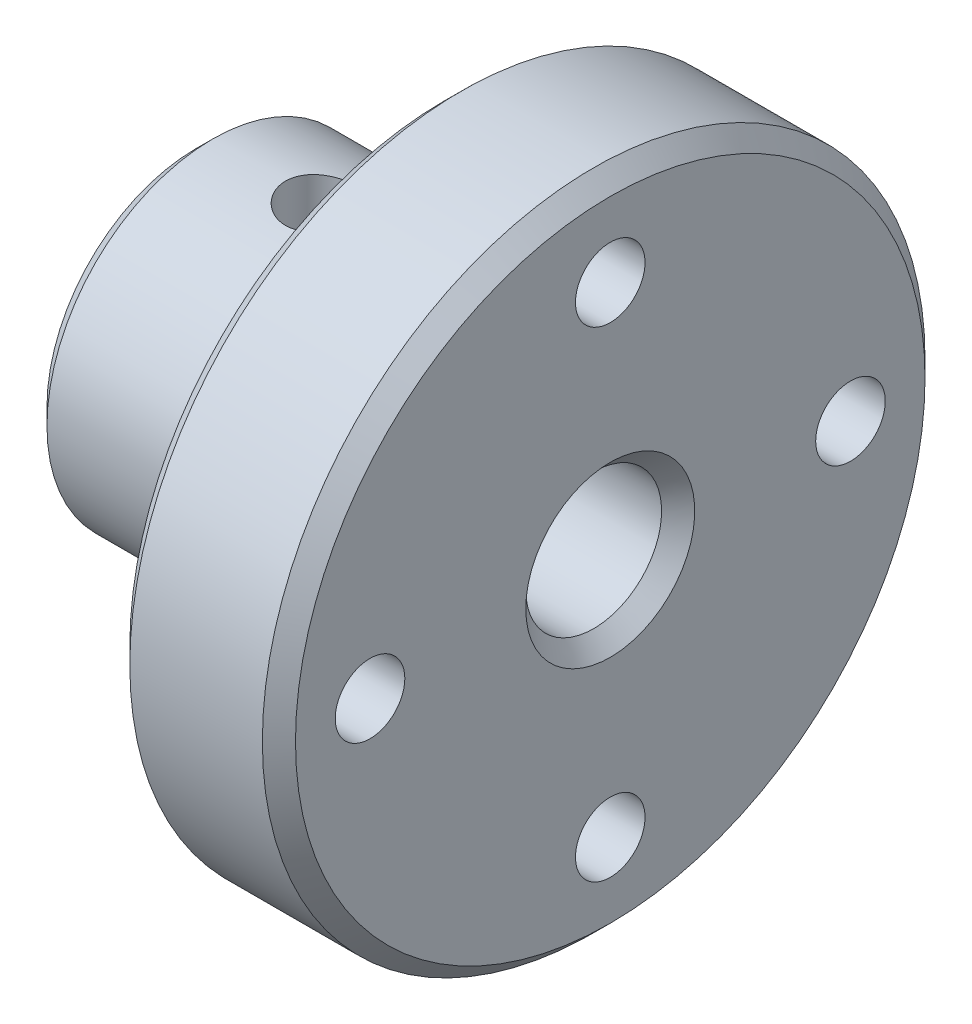
ISO-10303-21;
HEADER;
FILE_DESCRIPTION(('STEP AP214'),'2;1');
FILE_NAME('part.step','',(''),(''),'','','');
FILE_SCHEMA(('AUTOMOTIVE_DESIGN { 1 0 10303 214 1 1 1 1 }'));
ENDSEC;
DATA;
#1=APPLICATION_CONTEXT('core data for automotive mechanical design processes');
#2=APPLICATION_PROTOCOL_DEFINITION('international standard','automotive_design',2000,#1);
#3=PRODUCT_CONTEXT('',#1,'mechanical');
#4=PRODUCT('Part','Part','',(#3));
#5=PRODUCT_RELATED_PRODUCT_CATEGORY('part','',(#4));
#6=PRODUCT_DEFINITION_FORMATION('','',#4);
#7=PRODUCT_DEFINITION_CONTEXT('part definition',#1,'design');
#8=PRODUCT_DEFINITION('design','',#6,#7);
#9=PRODUCT_DEFINITION_SHAPE('','',#8);
#10=(LENGTH_UNIT() NAMED_UNIT(*) SI_UNIT(.MILLI.,.METRE.));
#11=(NAMED_UNIT(*) PLANE_ANGLE_UNIT() SI_UNIT($,.RADIAN.));
#12=(NAMED_UNIT(*) SI_UNIT($,.STERADIAN.) SOLID_ANGLE_UNIT());
#13=UNCERTAINTY_MEASURE_WITH_UNIT(LENGTH_MEASURE(1.E-05),#10,'distance_accuracy_value','');
#14=(GEOMETRIC_REPRESENTATION_CONTEXT(3) GLOBAL_UNCERTAINTY_ASSIGNED_CONTEXT((#13)) GLOBAL_UNIT_ASSIGNED_CONTEXT((#10,
#11,#12)) REPRESENTATION_CONTEXT('',''));
#15=CARTESIAN_POINT('',(0.,0.,0.));
#16=DIRECTION('',(0.,0.,1.));
#17=DIRECTION('',(1.,0.,0.));
#18=AXIS2_PLACEMENT_3D('',#15,#16,#17);
#19=CARTESIAN_POINT('',(0.,0.,0.));
#20=DIRECTION('',(-1.,0.,0.));
#21=DIRECTION('',(0.,0.,1.));
#22=AXIS2_PLACEMENT_3D('',#19,#20,#21);
#23=CYLINDRICAL_SURFACE('',#22,4.1);
#24=CARTESIAN_POINT('',(1.00000000000001,0.,0.));
#25=DIRECTION('',(1.,0.,0.));
#26=DIRECTION('',(0.,0.,-1.));
#27=AXIS2_PLACEMENT_3D('',#24,#25,#26);
#28=CIRCLE('',#27,4.1);
#29=CARTESIAN_POINT('',(1.00000000000001,0.,-4.1));
#30=VERTEX_POINT('',#29);
#31=EDGE_CURVE('E62',#30,#30,#28,.F.);
#32=ORIENTED_EDGE('',*,*,#31,.T.);
#33=EDGE_LOOP('',(#32));
#34=FACE_BOUND('',#33,.T.);
#35=CARTESIAN_POINT('',(24.,0.,0.));
#36=DIRECTION('',(-1.,0.,0.));
#37=DIRECTION('',(0.,0.,1.));
#38=AXIS2_PLACEMENT_3D('',#35,#36,#37);
#39=CIRCLE('',#38,4.1);
#40=CARTESIAN_POINT('',(24.,0.,4.1));
#41=VERTEX_POINT('',#40);
#42=EDGE_CURVE('E65',#41,#41,#39,.F.);
#43=ORIENTED_EDGE('',*,*,#42,.T.);
#44=EDGE_LOOP('',(#43));
#45=FACE_BOUND('',#44,.T.);
#46=CARTESIAN_POINT('',(7.5,-2.1,-3.52136337233179));
#47=CARTESIAN_POINT('',(7.39099716007748,-2.09999078633241,-3.52137486477347));
#48=CARTESIAN_POINT('',(7.28186167507207,-2.0914551354969,-3.52650292505262));
#49=CARTESIAN_POINT('',(7.06697691113417,-2.05776033264569,-3.54626250957944));
#50=CARTESIAN_POINT('',(6.96123484115513,-2.03256796777303,-3.56091302024119));
#51=CARTESIAN_POINT('',(6.75665229133361,-1.96695536789686,-3.59756539948229));
#52=CARTESIAN_POINT('',(6.65777719662686,-1.92661925616632,-3.619526582386));
#53=CARTESIAN_POINT('',(6.46822446462956,-1.83212125482373,-3.66826250412425));
#54=CARTESIAN_POINT('',(6.37754760984279,-1.77795804732867,-3.69503770171839));
#55=CARTESIAN_POINT('',(6.19828223365247,-1.65183522015836,-3.75322048964378));
#56=CARTESIAN_POINT('',(6.11055802658349,-1.57873901368763,-3.78482844101714));
#57=CARTESIAN_POINT('',(5.94793677008591,-1.41918479214795,-3.84750101071142));
#58=CARTESIAN_POINT('',(5.873046395689,-1.33271986804998,-3.87856533879134));
#59=CARTESIAN_POINT('',(5.73296254122294,-1.14132342174597,-3.93930878051318));
#60=CARTESIAN_POINT('',(5.66884727484409,-1.03551296289078,-3.96872946364212));
#61=CARTESIAN_POINT('',(5.55972402921364,-0.81281753480833,-4.02024258658299));
#62=CARTESIAN_POINT('',(5.51470340669017,-0.695939956451907,-4.04233987336141));
#63=CARTESIAN_POINT('',(5.44852082883964,-0.463597798534307,-4.0752677391531));
#64=CARTESIAN_POINT('',(5.42583887604325,-0.348669592843185,-4.08681150971175));
#65=CARTESIAN_POINT('',(5.39995649691105,-0.116105362969557,-4.10000620417996));
#66=CARTESIAN_POINT('',(5.39674360760703,0.00152888053545521,-4.1016634568558));
#67=CARTESIAN_POINT('',(5.40933906270086,0.224674100398984,-4.09522254210363));
#68=CARTESIAN_POINT('',(5.42344036977431,0.33031279683432,-4.08799978432975));
#69=CARTESIAN_POINT('',(5.46718779252953,0.537479286554548,-4.06595244150206));
#70=CARTESIAN_POINT('',(5.4968350768402,0.639006770171424,-4.0511272849593));
#71=CARTESIAN_POINT('',(5.57098487278224,0.836785286451114,-4.01497709420243));
#72=CARTESIAN_POINT('',(5.61567905484388,0.932948557019093,-3.99356852041728));
#73=CARTESIAN_POINT('',(5.71836791336754,1.11663393134248,-3.9461551292565));
#74=CARTESIAN_POINT('',(5.7763672624311,1.20415298387772,-3.92014869791063));
#75=CARTESIAN_POINT('',(5.91052955727717,1.37721328622468,-3.86294966685394));
#76=CARTESIAN_POINT('',(5.98791480906637,1.46172214842558,-3.83149859784546));
#77=CARTESIAN_POINT('',(6.15540094952667,1.61713399733502,-3.76854382778214));
#78=CARTESIAN_POINT('',(6.24551234986221,1.68802562093958,-3.73704010470898));
#79=CARTESIAN_POINT('',(6.44347882481126,1.8190101566289,-3.67516090651259));
#80=CARTESIAN_POINT('',(6.55212944065442,1.87801947979873,-3.6450135259034));
#81=CARTESIAN_POINT('',(6.7796975507954,1.97648423577963,-3.59258283180709));
#82=CARTESIAN_POINT('',(6.8986037697535,2.01596082965148,-3.57029101545339));
#83=CARTESIAN_POINT('',(7.13330689215691,2.07095804126888,-3.5386539527029));
#84=CARTESIAN_POINT('',(7.24858695301117,2.08814755775487,-3.5284129520289));
#85=CARTESIAN_POINT('',(7.48080924189519,2.10312595050657,-3.51951059684917));
#86=CARTESIAN_POINT('',(7.59775008104108,2.10093018272969,-3.52084007683235));
#87=CARTESIAN_POINT('',(7.8152896532348,2.07873216819312,-3.53397624898898));
#88=CARTESIAN_POINT('',(7.91619361034296,2.06085325262834,-3.54453306923508));
#89=CARTESIAN_POINT('',(8.11335678872553,2.01100455174625,-3.57304896568941));
#90=CARTESIAN_POINT('',(8.20961439245471,1.97902989794568,-3.59101059928402));
#91=CARTESIAN_POINT('',(8.39980059476457,1.90037797006908,-3.63326773913125));
#92=CARTESIAN_POINT('',(8.49341967733102,1.85309340188284,-3.65781605208957));
#93=CARTESIAN_POINT('',(8.67194342254121,1.74568453755184,-3.71027714367872));
#94=CARTESIAN_POINT('',(8.75684356259206,1.68555362720845,-3.73819165222636));
#95=CARTESIAN_POINT('',(8.92739001229676,1.54478392420298,-3.79871810419215));
#96=CARTESIAN_POINT('',(9.01162135949285,1.46247870022158,-3.83145947163289));
#97=CARTESIAN_POINT('',(9.16555058030047,1.28444293437597,-3.89475703722149));
#98=CARTESIAN_POINT('',(9.23524275283593,1.18870715066076,-3.92531237511302));
#99=CARTESIAN_POINT('',(9.36002938924818,0.98247486869778,-3.98202463399643));
#100=CARTESIAN_POINT('',(9.41459454478444,0.871608250811508,-4.00801257693763));
#101=CARTESIAN_POINT('',(9.50374212597275,0.640555033237004,-4.05135230445218));
#102=CARTESIAN_POINT('',(9.53834293110012,0.520377121672221,-4.06871203024193));
#103=CARTESIAN_POINT('',(9.58346452866948,0.286370348991018,-4.09151417515367));
#104=CARTESIAN_POINT('',(9.59595215219927,0.173014967485471,-4.09792788291553));
#105=CARTESIAN_POINT('',(9.6023709132606,-0.05434125954466,-4.10121332613935));
#106=CARTESIAN_POINT('',(9.59630922996443,-0.1683418383101,-4.09808875322075));
#107=CARTESIAN_POINT('',(9.5670647337868,-0.385174314746335,-4.08321190087042));
#108=CARTESIAN_POINT('',(9.54513299166698,-0.488223131903672,-4.07209041836965));
#109=CARTESIAN_POINT('',(9.48651300667933,-0.688989909791814,-4.04296777344969));
#110=CARTESIAN_POINT('',(9.44982274348931,-0.786707138590608,-4.02496566914582));
#111=CARTESIAN_POINT('',(9.36118364373815,-0.978582905867735,-3.98276605427874));
#112=CARTESIAN_POINT('',(9.30866820401404,-1.07242873938068,-3.95834376210161));
#113=CARTESIAN_POINT('',(9.19057447293801,-1.25034991998231,-3.905796325315));
#114=CARTESIAN_POINT('',(9.12499026164888,-1.33442081175526,-3.87766950458021));
#115=CARTESIAN_POINT('',(8.97474852004929,-1.49961155428171,-3.8170257614052));
#116=CARTESIAN_POINT('',(8.88881848246786,-1.5795217703089,-3.78435601993493));
#117=CARTESIAN_POINT('',(8.70443396667384,-1.72427026052579,-3.72063953216568));
#118=CARTESIAN_POINT('',(8.6059675827427,-1.78909403949489,-3.68959436879288));
#119=CARTESIAN_POINT('',(8.39412503562649,-1.90409524841187,-3.63163236720747));
#120=CARTESIAN_POINT('',(8.280314812318,-1.95359644444202,-3.60492589171972));
#121=CARTESIAN_POINT('',(8.10342245686492,-2.01239883140688,-3.5722185327406));
#122=CARTESIAN_POINT('',(8.04348511200379,-2.02941640211474,-3.56254683824887));
#123=CARTESIAN_POINT('',(7.92197714688437,-2.05811129060743,-3.54604777397735));
#124=CARTESIAN_POINT('',(7.86040767877202,-2.06979227468359,-3.53921845174575));
#125=CARTESIAN_POINT('',(7.74904246281674,-2.08577480924767,-3.52981733418345));
#126=CARTESIAN_POINT('',(7.69944083034209,-2.09110209584526,-3.52665758479641));
#127=CARTESIAN_POINT('',(7.59990210332817,-2.0982169190676,-3.522427901328));
#128=CARTESIAN_POINT('',(7.54996498698874,-2.10000422338338,-3.52135810439842));
#129=CARTESIAN_POINT('',(7.5,-2.1,-3.52136337233179));
#130=B_SPLINE_CURVE_WITH_KNOTS('',3,(#46,#47,#48,#49,#50,#51,#52,#53,#54,#55,#56,#57,#58,#59,
#60,#61,#62,#63,#64,#65,#66,#67,#68,#69,#70,#71,#72,#73,#74,#75,#76,#77,#78,#79,#80,#81,#82,#83,
#84,#85,#86,#87,#88,#89,#90,#91,#92,#93,#94,#95,#96,#97,#98,#99,#100,#101,#102,#103,#104,#105,
#106,#107,#108,#109,#110,#111,#112,#113,#114,#115,#116,#117,#118,#119,#120,#121,#122,#123,#124,
#125,#126,#127,#128,#129),.UNSPECIFIED.,.T.,.F.,(4,2,2,2,2,2,2,2,2,2,2,2,2,2,2,2,2,2,2,2,2,2,2,
2,2,2,2,2,2,2,2,2,2,2,2,2,2,2,2,2,2,4),(0.,0.326805925360341,0.654265462516,0.979932253178956,
1.30563009527061,1.65959605872069,2.01374556904469,2.39325194253315,2.77250663698832,
3.12367466749484,3.47461787677468,3.79357364823396,4.11255339981173,4.435760622031,
4.75908152465828,5.11405456663958,5.4693225463621,5.84912063319533,6.22850635449738,
6.57743208667882,6.92608144387648,7.23375014285411,7.54152518992567,7.8634220995326,
8.18548514541258,8.55056511877878,8.91578797871476,9.29252167595737,9.66890799094017,
10.0097201398452,10.3504004002835,10.6667992787001,10.983241484313,11.31272704368,
11.6423621952333,12.006173065086,12.3703320586078,12.7488119576434,12.9377147981518,
13.1264876645347,13.2762799300916,13.4260820253405),.UNSPECIFIED.);
#131=CARTESIAN_POINT('',(7.5,-2.1,-3.52136337233179));
#132=VERTEX_POINT('',#131);
#133=EDGE_CURVE('E77',#132,#132,#130,.T.);
#134=ORIENTED_EDGE('',*,*,#133,.T.);
#135=EDGE_LOOP('',(#134));
#136=FACE_BOUND('',#135,.T.);
#137=CARTESIAN_POINT('',(7.5,3.5213633723318,-2.09999999999999));
#138=CARTESIAN_POINT('',(7.39099716007748,3.52137486477347,-2.09999078633239));
#139=CARTESIAN_POINT('',(7.28186167507207,3.52650292505263,-2.09145513549689));
#140=CARTESIAN_POINT('',(7.06697691113417,3.54626250957944,-2.05776033264568));
#141=CARTESIAN_POINT('',(6.96123484115513,3.56091302024119,-2.03256796777302));
#142=CARTESIAN_POINT('',(6.75665229133361,3.59756539948229,-1.96695536789685));
#143=CARTESIAN_POINT('',(6.65777719662686,3.61952658238601,-1.9266192561663));
#144=CARTESIAN_POINT('',(6.46822446462956,3.66826250412426,-1.83212125482372));
#145=CARTESIAN_POINT('',(6.37754760984279,3.6950377017184,-1.77795804732866));
#146=CARTESIAN_POINT('',(6.19828223365247,3.75322048964379,-1.65183522015835));
#147=CARTESIAN_POINT('',(6.11055802658349,3.78482844101715,-1.57873901368762));
#148=CARTESIAN_POINT('',(5.94793677008591,3.84750101071143,-1.41918479214794));
#149=CARTESIAN_POINT('',(5.873046395689,3.87856533879135,-1.33271986804996));
#150=CARTESIAN_POINT('',(5.73296254122294,3.93930878051318,-1.14132342174596));
#151=CARTESIAN_POINT('',(5.66884727484409,3.96872946364212,-1.03551296289077));
#152=CARTESIAN_POINT('',(5.55972402921364,4.020242586583,-0.812817534808316));
#153=CARTESIAN_POINT('',(5.51470340669017,4.04233987336141,-0.695939956451893));
#154=CARTESIAN_POINT('',(5.44852082883964,4.07526773915311,-0.463597798534293));
#155=CARTESIAN_POINT('',(5.42583887604325,4.08681150971175,-0.348669592843171));
#156=CARTESIAN_POINT('',(5.39995649691105,4.10000620417996,-0.116105362969542));
#157=CARTESIAN_POINT('',(5.39674360760703,4.1016634568558,0.00152888053546951));
#158=CARTESIAN_POINT('',(5.40933906270086,4.09522254210363,0.224674100398998));
#159=CARTESIAN_POINT('',(5.42344036977431,4.08799978432975,0.330312796834334));
#160=CARTESIAN_POINT('',(5.46718779252953,4.06595244150205,0.537479286554562));
#161=CARTESIAN_POINT('',(5.4968350768402,4.0511272849593,0.639006770171438));
#162=CARTESIAN_POINT('',(5.57098487278224,4.01497709420242,0.836785286451128));
#163=CARTESIAN_POINT('',(5.61567905484388,3.99356852041727,0.932948557019107));
#164=CARTESIAN_POINT('',(5.71836791336754,3.9461551292565,1.11663393134249));
#165=CARTESIAN_POINT('',(5.7763672624311,3.92014869791063,1.20415298387773));
#166=CARTESIAN_POINT('',(5.91052955727717,3.86294966685394,1.37721328622469));
#167=CARTESIAN_POINT('',(5.98791480906637,3.83149859784546,1.46172214842559));
#168=CARTESIAN_POINT('',(6.15540094952667,3.76854382778213,1.61713399733503));
#169=CARTESIAN_POINT('',(6.24551234986221,3.73704010470898,1.68802562093959));
#170=CARTESIAN_POINT('',(6.44347882481126,3.67516090651259,1.81901015662891));
#171=CARTESIAN_POINT('',(6.55212944065442,3.64501352590339,1.87801947979875));
#172=CARTESIAN_POINT('',(6.7796975507954,3.59258283180708,1.97648423577964));
#173=CARTESIAN_POINT('',(6.8986037697535,3.57029101545339,2.01596082965149));
#174=CARTESIAN_POINT('',(7.13330689215691,3.53865395270289,2.07095804126889));
#175=CARTESIAN_POINT('',(7.24858695301117,3.52841295202889,2.08814755775488));
#176=CARTESIAN_POINT('',(7.48080924189519,3.51951059684917,2.10312595050658));
#177=CARTESIAN_POINT('',(7.59775008104108,3.52084007683234,2.10093018272971));
#178=CARTESIAN_POINT('',(7.8152896532348,3.53397624898898,2.07873216819313));
#179=CARTESIAN_POINT('',(7.91619361034296,3.54453306923508,2.06085325262835));
#180=CARTESIAN_POINT('',(8.11335678872553,3.5730489656894,2.01100455174626));
#181=CARTESIAN_POINT('',(8.20961439245471,3.59101059928401,1.97902989794569));
#182=CARTESIAN_POINT('',(8.39980059476457,3.63326773913125,1.9003779700691));
#183=CARTESIAN_POINT('',(8.49341967733102,3.65781605208956,1.85309340188285));
#184=CARTESIAN_POINT('',(8.67194342254121,3.71027714367871,1.74568453755186));
#185=CARTESIAN_POINT('',(8.75684356259206,3.73819165222636,1.68555362720846));
#186=CARTESIAN_POINT('',(8.92739001229676,3.79871810419214,1.54478392420299));
#187=CARTESIAN_POINT('',(9.01162135949285,3.83145947163289,1.4624787002216));
#188=CARTESIAN_POINT('',(9.16555058030048,3.89475703722149,1.28444293437598));
#189=CARTESIAN_POINT('',(9.23524275283593,3.92531237511302,1.18870715066077));
#190=CARTESIAN_POINT('',(9.36002938924818,3.98202463399643,0.982474868697794));
#191=CARTESIAN_POINT('',(9.41459454478444,4.00801257693762,0.871608250811522));
#192=CARTESIAN_POINT('',(9.50374212597275,4.05135230445217,0.640555033237018));
#193=CARTESIAN_POINT('',(9.53834293110012,4.06871203024193,0.520377121672235));
#194=CARTESIAN_POINT('',(9.58346452866948,4.09151417515366,0.286370348991033));
#195=CARTESIAN_POINT('',(9.59595215219927,4.09792788291553,0.173014967485487));
#196=CARTESIAN_POINT('',(9.6023709132606,4.10121332613935,-0.0543412595446445));
#197=CARTESIAN_POINT('',(9.59630922996443,4.09808875322075,-0.168341838310085));
#198=CARTESIAN_POINT('',(9.5670647337868,4.08321190087042,-0.385174314746321));
#199=CARTESIAN_POINT('',(9.54513299166698,4.07209041836966,-0.488223131903659));
#200=CARTESIAN_POINT('',(9.48651300667933,4.0429677734497,-0.688989909791801));
#201=CARTESIAN_POINT('',(9.44982274348931,4.02496566914582,-0.786707138590595));
#202=CARTESIAN_POINT('',(9.36118364373815,3.98276605427875,-0.97858290586772));
#203=CARTESIAN_POINT('',(9.30866820401404,3.95834376210161,-1.07242873938067));
#204=CARTESIAN_POINT('',(9.19057447293801,3.90579632531501,-1.2503499199823));
#205=CARTESIAN_POINT('',(9.12499026164888,3.87766950458021,-1.33442081175525));
#206=CARTESIAN_POINT('',(8.97474852004929,3.81702576140521,-1.4996115542817));
#207=CARTESIAN_POINT('',(8.88881848246785,3.78435601993493,-1.57952177030889));
#208=CARTESIAN_POINT('',(8.70443396667384,3.72063953216569,-1.72427026052578));
#209=CARTESIAN_POINT('',(8.6059675827427,3.68959436879289,-1.78909403949488));
#210=CARTESIAN_POINT('',(8.39412503562649,3.63163236720747,-1.90409524841185));
#211=CARTESIAN_POINT('',(8.280314812318,3.60492589171973,-1.95359644444201));
#212=CARTESIAN_POINT('',(8.10342245686493,3.57221853274061,-2.01239883140687));
#213=CARTESIAN_POINT('',(8.0434851120038,3.56254683824887,-2.02941640211473));
#214=CARTESIAN_POINT('',(7.92197714688437,3.54604777397736,-2.05811129060741));
#215=CARTESIAN_POINT('',(7.86040767877202,3.53921845174576,-2.06979227468358));
#216=CARTESIAN_POINT('',(7.74904246281674,3.52981733418346,-2.08577480924766));
#217=CARTESIAN_POINT('',(7.69944083034209,3.52665758479642,-2.09110209584525));
#218=CARTESIAN_POINT('',(7.59990210332817,3.522427901328,-2.09821691906759));
#219=CARTESIAN_POINT('',(7.54996498698874,3.52135810439843,-2.10000422338336));
#220=CARTESIAN_POINT('',(7.5,3.5213633723318,-2.09999999999999));
#221=B_SPLINE_CURVE_WITH_KNOTS('',3,(#137,#138,#139,#140,#141,#142,#143,#144,#145,#146,#147,
#148,#149,#150,#151,#152,#153,#154,#155,#156,#157,#158,#159,#160,#161,#162,#163,#164,#165,#166,
#167,#168,#169,#170,#171,#172,#173,#174,#175,#176,#177,#178,#179,#180,#181,#182,#183,#184,#185,
#186,#187,#188,#189,#190,#191,#192,#193,#194,#195,#196,#197,#198,#199,#200,#201,#202,#203,#204,
#205,#206,#207,#208,#209,#210,#211,#212,#213,#214,#215,#216,#217,#218,#219,#220),.UNSPECIFIED.,
.T.,.F.,(4,2,2,2,2,2,2,2,2,2,2,2,2,2,2,2,2,2,2,2,2,2,2,2,2,2,2,2,2,2,2,2,2,2,2,2,2,2,2,2,2,4),
(0.,0.326805925360341,0.654265462516,0.979932253178956,1.30563009527061,1.65959605872069,
2.01374556904469,2.39325194253315,2.77250663698832,3.12367466749484,3.47461787677468,
3.79357364823396,4.11255339981173,4.435760622031,4.75908152465828,5.11405456663958,
5.4693225463621,5.84912063319533,6.22850635449738,6.57743208667882,6.92608144387649,
7.23375014285411,7.54152518992567,7.8634220995326,8.18548514541258,8.55056511877879,
8.91578797871476,9.29252167595737,9.66890799094018,10.0097201398452,10.3504004002835,
10.6667992787001,10.983241484313,11.31272704368,11.6423621952333,12.006173065086,
12.3703320586078,12.7488119576434,12.9377147981518,13.1264876645347,13.2762799300916,
13.4260820253405),.UNSPECIFIED.);
#222=CARTESIAN_POINT('',(7.5,3.5213633723318,-2.09999999999999));
#223=VERTEX_POINT('',#222);
#224=EDGE_CURVE('E76',#223,#223,#221,.T.);
#225=ORIENTED_EDGE('',*,*,#224,.T.);
#226=EDGE_LOOP('',(#225));
#227=FACE_BOUND('',#226,.T.);
#228=ADVANCED_FACE('F30',(#34,#45,#136,#227),#23,.F.);
#229=CARTESIAN_POINT('',(0.,4.1,0.));
#230=DIRECTION('',(1.,0.,0.));
#231=DIRECTION('',(0.,0.,-1.));
#232=AXIS2_PLACEMENT_3D('',#229,#230,#231);
#233=PLANE('',#232);
#234=CARTESIAN_POINT('',(0.,0.,0.));
#235=DIRECTION('',(1.,0.,0.));
#236=DIRECTION('',(0.,0.,-1.));
#237=AXIS2_PLACEMENT_3D('',#234,#235,#236);
#238=CIRCLE('',#237,5.10000000000001);
#239=CARTESIAN_POINT('',(0.,0.,-5.10000000000001));
#240=VERTEX_POINT('',#239);
#241=EDGE_CURVE('E56',#240,#240,#238,.T.);
#242=ORIENTED_EDGE('',*,*,#241,.T.);
#243=EDGE_LOOP('',(#242));
#244=FACE_BOUND('',#243,.T.);
#245=CARTESIAN_POINT('',(0.,0.,0.));
#246=DIRECTION('',(1.,0.,0.));
#247=DIRECTION('',(0.,0.,-1.));
#248=AXIS2_PLACEMENT_3D('',#245,#246,#247);
#249=CIRCLE('',#248,9.00000000000001);
#250=CARTESIAN_POINT('',(0.,0.,-9.00000000000001));
#251=VERTEX_POINT('',#250);
#252=EDGE_CURVE('E59',#251,#251,#249,.F.);
#253=ORIENTED_EDGE('',*,*,#252,.T.);
#254=EDGE_LOOP('',(#253));
#255=FACE_BOUND('',#254,.T.);
#256=ADVANCED_FACE('F111',(#244,#255),#233,.F.);
#257=CARTESIAN_POINT('',(0.,0.,0.));
#258=DIRECTION('',(-1.,0.,0.));
#259=DIRECTION('',(0.,0.,1.));
#260=AXIS2_PLACEMENT_3D('',#257,#258,#259);
#261=CYLINDRICAL_SURFACE('',#260,10.);
#262=CARTESIAN_POINT('',(1.00000000000001,0.,0.));
#263=DIRECTION('',(1.,0.,0.));
#264=DIRECTION('',(0.,0.,-1.));
#265=AXIS2_PLACEMENT_3D('',#262,#263,#264);
#266=CIRCLE('',#265,10.);
#267=CARTESIAN_POINT('',(1.00000000000001,0.,-10.));
#268=VERTEX_POINT('',#267);
#269=EDGE_CURVE('E10',#268,#268,#266,.T.);
#270=ORIENTED_EDGE('',*,*,#269,.T.);
#271=EDGE_LOOP('',(#270));
#272=FACE_BOUND('',#271,.T.);
#273=CARTESIAN_POINT('',(7.5,-2.10000000000003,-9.77701385904714));
#274=CARTESIAN_POINT('',(7.6165538949492,-2.09999584213836,-9.77701620575199));
#275=CARTESIAN_POINT('',(7.73315888489897,-2.09026358288366,-9.77912073704029));
#276=CARTESIAN_POINT('',(7.96306111177203,-2.0516294314064,-9.78729749001667));
#277=CARTESIAN_POINT('',(8.07635576755396,-2.02271297644461,-9.79337272581787));
#278=CARTESIAN_POINT('',(8.29627823420808,-1.94665421694585,-9.80877317983934));
#279=CARTESIAN_POINT('',(8.40291289770303,-1.89953101698948,-9.81809499037799));
#280=CARTESIAN_POINT('',(8.60676269383979,-1.78845000471819,-9.83893418461404));
#281=CARTESIAN_POINT('',(8.70397817749329,-1.72449282006275,-9.85045148644757));
#282=CARTESIAN_POINT('',(8.88774778641344,-1.58049721435023,-9.87458441963537));
#283=CARTESIAN_POINT('',(8.97413379748274,-1.50024640417443,-9.88721315866861));
#284=CARTESIAN_POINT('',(9.13232215989059,-1.32640026371476,-9.91203098393378));
#285=CARTESIAN_POINT('',(9.20412343172918,-1.23280394652558,-9.9242200375672));
#286=CARTESIAN_POINT('',(9.33176314694531,-1.03380306339506,-9.94692721877274));
#287=CARTESIAN_POINT('',(9.38744081217687,-0.92829323464156,-9.95742808128039));
#288=CARTESIAN_POINT('',(9.48021394290252,-0.709158045951421,-9.97542804397668));
#289=CARTESIAN_POINT('',(9.51731132810406,-0.595533525808205,-9.98292745425812));
#290=CARTESIAN_POINT('',(9.57134465769674,-0.365140826902535,-9.99398691633027));
#291=CARTESIAN_POINT('',(9.588564831898,-0.248442015739036,-9.99760245135055));
#292=CARTESIAN_POINT('',(9.60324269262344,-0.0137595822552981,-10.0006787328778));
#293=CARTESIAN_POINT('',(9.60070247019647,0.104223902801089,-10.0001399189988));
#294=CARTESIAN_POINT('',(9.57614518823377,0.336170177799068,-9.99501089657754));
#295=CARTESIAN_POINT('',(9.5544343938484,0.450167008517311,-9.99048439709474));
#296=CARTESIAN_POINT('',(9.49263922090948,0.672862446529587,-9.97796083144945));
#297=CARTESIAN_POINT('',(9.45255405565291,0.781560826748734,-9.96996361668825));
#298=CARTESIAN_POINT('',(9.3548710240715,0.991435198330695,-9.95129351656736));
#299=CARTESIAN_POINT('',(9.29715521519371,1.09255463452519,-9.94060269907274));
#300=CARTESIAN_POINT('',(9.16593685445078,1.28378568581581,-9.9177206613887));
#301=CARTESIAN_POINT('',(9.09243231015062,1.37389590936783,-9.90552925191739));
#302=CARTESIAN_POINT('',(8.93004947200449,1.54237032672096,-9.88071330088177));
#303=CARTESIAN_POINT('',(8.84090312207153,1.62047580661194,-9.86808493735781));
#304=CARTESIAN_POINT('',(8.65064820816938,1.76067369744357,-9.84403894716636));
#305=CARTESIAN_POINT('',(8.54953936914026,1.82276574007424,-9.83262134835008));
#306=CARTESIAN_POINT('',(8.33783365286724,1.92927679082105,-9.81228071146932));
#307=CARTESIAN_POINT('',(8.2272132040912,1.97365025977914,-9.80336411859266));
#308=CARTESIAN_POINT('',(7.99985511830747,2.04310257472957,-9.78912670564414));
#309=CARTESIAN_POINT('',(7.88311837099585,2.06818421869449,-9.78380536415185));
#310=CARTESIAN_POINT('',(7.64919627506456,2.09794661167432,-9.77746642200357));
#311=CARTESIAN_POINT('',(7.53206075760687,2.10300258737186,-9.77636967480561));
#312=CARTESIAN_POINT('',(7.29862038210275,2.09358306333842,-9.77839109907788));
#313=CARTESIAN_POINT('',(7.18231547224203,2.07910879281772,-9.78150900528292));
#314=CARTESIAN_POINT('',(6.95512264081272,2.03136423298959,-9.79153398235124));
#315=CARTESIAN_POINT('',(6.84418992943094,1.99829765833631,-9.79839996245527));
#316=CARTESIAN_POINT('',(6.62943920979146,1.91452638523142,-9.81511089151908));
#317=CARTESIAN_POINT('',(6.52562183900143,1.86382010889442,-9.82495610696358));
#318=CARTESIAN_POINT('',(6.32641636087484,1.7453713260063,-9.84669195643071));
#319=CARTESIAN_POINT('',(6.23116975387996,1.6773959364988,-9.85860978524534));
#320=CARTESIAN_POINT('',(6.05329793596734,1.52664592857996,-9.88307493841841));
#321=CARTESIAN_POINT('',(5.97067416603212,1.44386962288109,-9.89562233442935));
#322=CARTESIAN_POINT('',(5.8189530899686,1.26417592908601,-9.92019183241592));
#323=CARTESIAN_POINT('',(5.75011060302578,1.16704137830383,-9.9322013204181));
#324=CARTESIAN_POINT('',(5.6297214380146,0.962367917517089,-9.95411598711855));
#325=CARTESIAN_POINT('',(5.57817398845916,0.854829471879246,-9.96402125967322));
#326=CARTESIAN_POINT('',(5.49420093605734,0.633042101835961,-9.98055792326949));
#327=CARTESIAN_POINT('',(5.46165991924413,0.518838411838038,-9.98720903384848));
#328=CARTESIAN_POINT('',(5.41626038003926,0.286431072281437,-9.99657291708255));
#329=CARTESIAN_POINT('',(5.40339923138316,0.168227958595265,-9.99928621523341));
#330=CARTESIAN_POINT('',(5.39783481998171,-0.0663968326847373,-10.0004546679793));
#331=CARTESIAN_POINT('',(5.40474986009348,-0.182809222523899,-9.99899045340328));
#332=CARTESIAN_POINT('',(5.43769299745671,-0.412773355528477,-9.99213961453345));
#333=CARTESIAN_POINT('',(5.46372080200365,-0.526325142475365,-9.98675305030894));
#334=CARTESIAN_POINT('',(5.53397390672816,-0.74707677493612,-9.97266697098243));
#335=CARTESIAN_POINT('',(5.57814898985036,-0.854293222404373,-9.96397660305901));
#336=CARTESIAN_POINT('',(5.68339213141568,-1.05984502040711,-9.94421454514705));
#337=CARTESIAN_POINT('',(5.74446168791376,-1.15817958234707,-9.93314264400423));
#338=CARTESIAN_POINT('',(5.88302535232821,-1.34505042490911,-9.90958505805692));
#339=CARTESIAN_POINT('',(5.960790132749,-1.43338331494839,-9.89707788319043));
#340=CARTESIAN_POINT('',(6.12998587563935,-1.59587662228427,-9.87218068259497));
#341=CARTESIAN_POINT('',(6.22142009724633,-1.67003365006567,-9.85979068555522));
#342=CARTESIAN_POINT('',(6.41668951884853,-1.80292990758005,-9.83636439876653));
#343=CARTESIAN_POINT('',(6.52066148074443,-1.86147156082077,-9.82534631863206));
#344=CARTESIAN_POINT('',(6.73717321359544,-1.96015899207107,-9.80613706595801));
#345=CARTESIAN_POINT('',(6.84970538202509,-2.00032087619324,-9.79794341993895));
#346=CARTESIAN_POINT('',(7.05201749524366,-2.05364241150617,-9.78688354536944));
#347=CARTESIAN_POINT('',(7.14067206565896,-2.0709942486524,-9.78320619231999));
#348=CARTESIAN_POINT('',(7.31954092345683,-2.09417441335178,-9.77827049087592));
#349=CARTESIAN_POINT('',(7.40975514592708,-2.10000321933147,-9.7770120420505));
#350=CARTESIAN_POINT('',(7.5,-2.10000000000003,-9.77701385904714));
#351=B_SPLINE_CURVE_WITH_KNOTS('',3,(#273,#274,#275,#276,#277,#278,#279,#280,#281,#282,#283,
#284,#285,#286,#287,#288,#289,#290,#291,#292,#293,#294,#295,#296,#297,#298,#299,#300,#301,#302,
#303,#304,#305,#306,#307,#308,#309,#310,#311,#312,#313,#314,#315,#316,#317,#318,#319,#320,#321,
#322,#323,#324,#325,#326,#327,#328,#329,#330,#331,#332,#333,#334,#335,#336,#337,#338,#339,#340,
#341,#342,#343,#344,#345,#346,#347,#348,#349,#350),.UNSPECIFIED.,.T.,.F.,(4,2,2,2,2,2,2,2,2,2,2,
2,2,2,2,2,2,2,2,2,2,2,2,2,2,2,2,2,2,2,2,2,2,2,2,2,2,2,4),(0.,0.349331096202456,
0.698927673816448,1.04815840700841,1.39737612088656,1.75147768818651,2.10560545502615,
2.46315158639683,2.82066076861306,3.17299189978839,3.52528574772534,3.87205123629458,
4.2188315730968,4.56798452286016,4.91718155935248,5.2730825337892,5.62899169323893,
5.98580978942095,6.34257612504637,6.69262508230794,7.0426520089358,7.38891642511546,
7.73521182289146,8.08645110892441,8.43773046139285,8.79500286727606,9.15225933403778,
9.5073232287234,9.86233973625086,10.2105506351119,10.5587562013703,10.9060046369541,
11.2532838733837,11.6066878113069,11.960176144365,12.317945050162,12.6753998414514,
12.9458896676458,13.2163682630944),.UNSPECIFIED.);
#352=CARTESIAN_POINT('',(7.5,-2.10000000000003,-9.77701385904714));
#353=VERTEX_POINT('',#352);
#354=EDGE_CURVE('E198',#353,#353,#351,.T.);
#355=ORIENTED_EDGE('',*,*,#354,.T.);
#356=EDGE_LOOP('',(#355));
#357=FACE_BOUND('',#356,.T.);
#358=CARTESIAN_POINT('',(7.5,9.77701385904715,-2.09999999999999));
#359=CARTESIAN_POINT('',(7.6165538949492,9.777016205752,-2.09999584213833));
#360=CARTESIAN_POINT('',(7.73315888489897,9.77912073704029,-2.09026358288363));
#361=CARTESIAN_POINT('',(7.96306111177203,9.78729749001667,-2.05162943140637));
#362=CARTESIAN_POINT('',(8.07635576755396,9.79337272581788,-2.02271297644458));
#363=CARTESIAN_POINT('',(8.29627823420808,9.80877317983934,-1.94665421694582));
#364=CARTESIAN_POINT('',(8.40291289770303,9.818094990378,-1.89953101698944));
#365=CARTESIAN_POINT('',(8.60676269383979,9.83893418461405,-1.78845000471816));
#366=CARTESIAN_POINT('',(8.70397817749329,9.85045148644758,-1.72449282006271));
#367=CARTESIAN_POINT('',(8.88774778641344,9.87458441963537,-1.5804972143502));
#368=CARTESIAN_POINT('',(8.97413379748274,9.88721315866861,-1.5002464041744));
#369=CARTESIAN_POINT('',(9.13232215989059,9.91203098393378,-1.32640026371473));
#370=CARTESIAN_POINT('',(9.20412343172918,9.92422003756721,-1.23280394652554));
#371=CARTESIAN_POINT('',(9.33176314694531,9.94692721877275,-1.03380306339502));
#372=CARTESIAN_POINT('',(9.38744081217687,9.9574280812804,-0.928293234641525));
#373=CARTESIAN_POINT('',(9.48021394290252,9.97542804397668,-0.709158045951386));
#374=CARTESIAN_POINT('',(9.51731132810406,9.98292745425813,-0.59553352580817));
#375=CARTESIAN_POINT('',(9.57134465769674,9.99398691633027,-0.3651408269025));
#376=CARTESIAN_POINT('',(9.588564831898,9.99760245135055,-0.248442015739001));
#377=CARTESIAN_POINT('',(9.60324269262344,10.0006787328778,-0.0137595822552632));
#378=CARTESIAN_POINT('',(9.60070247019647,10.0001399189988,0.104223902801124));
#379=CARTESIAN_POINT('',(9.57614518823377,9.99501089657754,0.336170177799103));
#380=CARTESIAN_POINT('',(9.5544343938484,9.99048439709474,0.450167008517346));
#381=CARTESIAN_POINT('',(9.49263922090948,9.97796083144945,0.672862446529622));
#382=CARTESIAN_POINT('',(9.45255405565291,9.96996361668825,0.781560826748768));
#383=CARTESIAN_POINT('',(9.3548710240715,9.95129351656735,0.99143519833073));
#384=CARTESIAN_POINT('',(9.29715521519371,9.94060269907273,1.09255463452523));
#385=CARTESIAN_POINT('',(9.16593685445078,9.9177206613887,1.28378568581585));
#386=CARTESIAN_POINT('',(9.09243231015062,9.90552925191739,1.37389590936786));
#387=CARTESIAN_POINT('',(8.93004947200449,9.88071330088177,1.54237032672099));
#388=CARTESIAN_POINT('',(8.84090312207153,9.8680849373578,1.62047580661198));
#389=CARTESIAN_POINT('',(8.65064820816938,9.84403894716635,1.76067369744361));
#390=CARTESIAN_POINT('',(8.54953936914026,9.83262134835008,1.82276574007428));
#391=CARTESIAN_POINT('',(8.33783365286724,9.81228071146932,1.92927679082108));
#392=CARTESIAN_POINT('',(8.2272132040912,9.80336411859265,1.97365025977917));
#393=CARTESIAN_POINT('',(7.99985511830747,9.78912670564414,2.04310257472961));
#394=CARTESIAN_POINT('',(7.88311837099585,9.78380536415184,2.06818421869452));
#395=CARTESIAN_POINT('',(7.64919627506456,9.77746642200357,2.09794661167436));
#396=CARTESIAN_POINT('',(7.53206075760687,9.7763696748056,2.10300258737189));
#397=CARTESIAN_POINT('',(7.29862038210275,9.77839109907788,2.09358306333846));
#398=CARTESIAN_POINT('',(7.18231547224203,9.78150900528291,2.07910879281775));
#399=CARTESIAN_POINT('',(6.95512264081272,9.79153398235124,2.03136423298963));
#400=CARTESIAN_POINT('',(6.84418992943094,9.79839996245526,1.99829765833634));
#401=CARTESIAN_POINT('',(6.62943920979146,9.81511089151907,1.91452638523146));
#402=CARTESIAN_POINT('',(6.52562183900143,9.82495610696358,1.86382010889445));
#403=CARTESIAN_POINT('',(6.32641636087484,9.84669195643071,1.74537132600634));
#404=CARTESIAN_POINT('',(6.23116975387996,9.85860978524533,1.67739593649883));
#405=CARTESIAN_POINT('',(6.05329793596734,9.8830749384184,1.52664592858));
#406=CARTESIAN_POINT('',(5.97067416603212,9.89562233442934,1.44386962288113));
#407=CARTESIAN_POINT('',(5.8189530899686,9.92019183241591,1.26417592908605));
#408=CARTESIAN_POINT('',(5.75011060302578,9.93220132041809,1.16704137830387));
#409=CARTESIAN_POINT('',(5.6297214380146,9.95411598711854,0.962367917517123));
#410=CARTESIAN_POINT('',(5.57817398845916,9.96402125967321,0.85482947187928));
#411=CARTESIAN_POINT('',(5.49420093605734,9.98055792326949,0.633042101835996));
#412=CARTESIAN_POINT('',(5.46165991924413,9.98720903384848,0.518838411838073));
#413=CARTESIAN_POINT('',(5.41626038003926,9.99657291708255,0.286431072281472));
#414=CARTESIAN_POINT('',(5.40339923138316,9.99928621523341,0.1682279585953));
#415=CARTESIAN_POINT('',(5.39783481998171,10.0004546679793,-0.0663968326847024));
#416=CARTESIAN_POINT('',(5.40474986009348,9.99899045340328,-0.182809222523864));
#417=CARTESIAN_POINT('',(5.43769299745671,9.99213961453346,-0.412773355528442));
#418=CARTESIAN_POINT('',(5.46372080200365,9.98675305030894,-0.52632514247533));
#419=CARTESIAN_POINT('',(5.53397390672816,9.97266697098243,-0.747076774936085));
#420=CARTESIAN_POINT('',(5.57814898985036,9.96397660305902,-0.854293222404338));
#421=CARTESIAN_POINT('',(5.68339213141568,9.94421454514706,-1.05984502040708));
#422=CARTESIAN_POINT('',(5.74446168791376,9.93314264400423,-1.15817958234703));
#423=CARTESIAN_POINT('',(5.88302535232821,9.90958505805692,-1.34505042490908));
#424=CARTESIAN_POINT('',(5.960790132749,9.89707788319044,-1.43338331494835));
#425=CARTESIAN_POINT('',(6.12998587563935,9.87218068259497,-1.59587662228424));
#426=CARTESIAN_POINT('',(6.22142009724633,9.85979068555523,-1.67003365006564));
#427=CARTESIAN_POINT('',(6.41668951884853,9.83636439876654,-1.80292990758002));
#428=CARTESIAN_POINT('',(6.52066148074443,9.82534631863207,-1.86147156082073));
#429=CARTESIAN_POINT('',(6.73717321359544,9.80613706595802,-1.96015899207103));
#430=CARTESIAN_POINT('',(6.84970538202509,9.79794341993895,-2.0003208761932));
#431=CARTESIAN_POINT('',(7.05201749524366,9.78688354536945,-2.05364241150613));
#432=CARTESIAN_POINT('',(7.14067206565896,9.78320619232,-2.07099424865237));
#433=CARTESIAN_POINT('',(7.31954092345683,9.77827049087593,-2.09417441335174));
#434=CARTESIAN_POINT('',(7.40975514592708,9.7770120420505,-2.10000321933144));
#435=CARTESIAN_POINT('',(7.5,9.77701385904715,-2.09999999999999));
#436=B_SPLINE_CURVE_WITH_KNOTS('',3,(#358,#359,#360,#361,#362,#363,#364,#365,#366,#367,#368,
#369,#370,#371,#372,#373,#374,#375,#376,#377,#378,#379,#380,#381,#382,#383,#384,#385,#386,#387,
#388,#389,#390,#391,#392,#393,#394,#395,#396,#397,#398,#399,#400,#401,#402,#403,#404,#405,#406,
#407,#408,#409,#410,#411,#412,#413,#414,#415,#416,#417,#418,#419,#420,#421,#422,#423,#424,#425,
#426,#427,#428,#429,#430,#431,#432,#433,#434,#435),.UNSPECIFIED.,.T.,.F.,(4,2,2,2,2,2,2,2,2,2,2,
2,2,2,2,2,2,2,2,2,2,2,2,2,2,2,2,2,2,2,2,2,2,2,2,2,2,2,4),(0.,0.349331096202456,
0.698927673816448,1.04815840700841,1.39737612088656,1.75147768818651,2.10560545502615,
2.46315158639683,2.82066076861306,3.17299189978839,3.52528574772534,3.87205123629458,
4.2188315730968,4.56798452286016,4.91718155935248,5.2730825337892,5.62899169323893,
5.98580978942095,6.34257612504637,6.69262508230794,7.0426520089358,7.38891642511546,
7.73521182289146,8.0864511089244,8.43773046139285,8.79500286727606,9.15225933403778,
9.5073232287234,9.86233973625086,10.2105506351119,10.5587562013703,10.9060046369541,
11.2532838733837,11.6066878113069,11.960176144365,12.317945050162,12.6753998414514,
12.9458896676458,13.2163682630944),.UNSPECIFIED.);
#437=CARTESIAN_POINT('',(7.5,9.77701385904715,-2.09999999999999));
#438=VERTEX_POINT('',#437);
#439=EDGE_CURVE('E69',#438,#438,#436,.T.);
#440=ORIENTED_EDGE('',*,*,#439,.T.);
#441=EDGE_LOOP('',(#440));
#442=FACE_BOUND('',#441,.T.);
#443=CARTESIAN_POINT('',(15.,0.,0.));
#444=DIRECTION('',(-1.,0.,0.));
#445=DIRECTION('',(0.,0.,1.));
#446=AXIS2_PLACEMENT_3D('',#443,#444,#445);
#447=CIRCLE('',#446,10.);
#448=CARTESIAN_POINT('',(15.,0.,10.));
#449=VERTEX_POINT('',#448);
#450=EDGE_CURVE('E68',#449,#449,#447,.T.);
#451=ORIENTED_EDGE('',*,*,#450,.T.);
#452=EDGE_LOOP('',(#451));
#453=FACE_BOUND('',#452,.T.);
#454=ADVANCED_FACE('F79',(#272,#357,#442,#453),#261,.T.);
#455=CARTESIAN_POINT('',(15.,10.,0.));
#456=DIRECTION('',(1.,0.,0.));
#457=DIRECTION('',(0.,0.,-1.));
#458=AXIS2_PLACEMENT_3D('',#455,#456,#457);
#459=PLANE('',#458);
#460=CARTESIAN_POINT('',(15.,0.,0.));
#461=DIRECTION('',(1.,0.,0.));
#462=DIRECTION('',(0.,0.,-1.));
#463=AXIS2_PLACEMENT_3D('',#460,#461,#462);
#464=CIRCLE('',#463,19.);
#465=CARTESIAN_POINT('',(15.,0.,-19.));
#466=VERTEX_POINT('',#465);
#467=EDGE_CURVE('E37',#466,#466,#464,.F.);
#468=ORIENTED_EDGE('',*,*,#467,.T.);
#469=EDGE_LOOP('',(#468));
#470=FACE_BOUND('',#469,.T.);
#471=CARTESIAN_POINT('',(15.,-14.5,1.51879438239676E-13));
#472=DIRECTION('',(1.,0.,0.));
#473=DIRECTION('',(0.,1.,0.));
#474=AXIS2_PLACEMENT_3D('',#471,#472,#473);
#475=CIRCLE('',#474,2.09999999999999);
#476=CARTESIAN_POINT('',(15.,-12.4,1.29883105804965E-13));
#477=VERTEX_POINT('',#476);
#478=EDGE_CURVE('E174',#477,#477,#475,.T.);
#479=ORIENTED_EDGE('',*,*,#478,.T.);
#480=EDGE_LOOP('',(#479));
#481=FACE_BOUND('',#480,.T.);
#482=CARTESIAN_POINT('',(15.,0.,-14.5));
#483=DIRECTION('',(1.,0.,0.));
#484=DIRECTION('',(0.,0.,1.));
#485=AXIS2_PLACEMENT_3D('',#482,#483,#484);
#486=CIRCLE('',#485,2.09999999999999);
#487=CARTESIAN_POINT('',(15.,0.,-12.4));
#488=VERTEX_POINT('',#487);
#489=EDGE_CURVE('E167',#488,#488,#486,.T.);
#490=ORIENTED_EDGE('',*,*,#489,.T.);
#491=EDGE_LOOP('',(#490));
#492=FACE_BOUND('',#491,.T.);
#493=CARTESIAN_POINT('',(15.,14.5,0.));
#494=DIRECTION('',(1.,0.,0.));
#495=DIRECTION('',(0.,-1.,0.));
#496=AXIS2_PLACEMENT_3D('',#493,#494,#495);
#497=CIRCLE('',#496,2.09999999999999);
#498=CARTESIAN_POINT('',(15.,12.4,0.));
#499=VERTEX_POINT('',#498);
#500=EDGE_CURVE('E172',#499,#499,#497,.T.);
#501=ORIENTED_EDGE('',*,*,#500,.T.);
#502=EDGE_LOOP('',(#501));
#503=FACE_BOUND('',#502,.T.);
#504=CARTESIAN_POINT('',(15.,0.,14.5));
#505=DIRECTION('',(1.,0.,0.));
#506=DIRECTION('',(0.,0.,-1.));
#507=AXIS2_PLACEMENT_3D('',#504,#505,#506);
#508=CIRCLE('',#507,2.09999999999999);
#509=CARTESIAN_POINT('',(15.,0.,12.4));
#510=VERTEX_POINT('',#509);
#511=EDGE_CURVE('E181',#510,#510,#508,.T.);
#512=ORIENTED_EDGE('',*,*,#511,.T.);
#513=EDGE_LOOP('',(#512));
#514=FACE_BOUND('',#513,.T.);
#515=ORIENTED_EDGE('',*,*,#450,.F.);
#516=EDGE_LOOP('',(#515));
#517=FACE_BOUND('',#516,.T.);
#518=ADVANCED_FACE('F137',(#470,#481,#492,#503,#514,#517),#459,.F.);
#519=CARTESIAN_POINT('',(0.,0.,0.));
#520=DIRECTION('',(-1.,0.,0.));
#521=DIRECTION('',(0.,0.,1.));
#522=AXIS2_PLACEMENT_3D('',#519,#520,#521);
#523=CYLINDRICAL_SURFACE('',#522,20.);
#524=CARTESIAN_POINT('',(24.,0.,0.));
#525=DIRECTION('',(-1.,0.,0.));
#526=DIRECTION('',(0.,0.,1.));
#527=AXIS2_PLACEMENT_3D('',#524,#525,#526);
#528=CIRCLE('',#527,20.);
#529=CARTESIAN_POINT('',(24.,0.,20.));
#530=VERTEX_POINT('',#529);
#531=EDGE_CURVE('E41',#530,#530,#528,.T.);
#532=ORIENTED_EDGE('',*,*,#531,.T.);
#533=EDGE_LOOP('',(#532));
#534=FACE_BOUND('',#533,.T.);
#535=CARTESIAN_POINT('',(16.,0.,0.));
#536=DIRECTION('',(1.,0.,0.));
#537=DIRECTION('',(0.,0.,-1.));
#538=AXIS2_PLACEMENT_3D('',#535,#536,#537);
#539=CIRCLE('',#538,20.);
#540=CARTESIAN_POINT('',(16.,0.,-20.));
#541=VERTEX_POINT('',#540);
#542=EDGE_CURVE('E45',#541,#541,#539,.T.);
#543=ORIENTED_EDGE('',*,*,#542,.T.);
#544=EDGE_LOOP('',(#543));
#545=FACE_BOUND('',#544,.T.);
#546=ADVANCED_FACE('F134',(#534,#545),#523,.T.);
#547=CARTESIAN_POINT('',(25.,20.,0.));
#548=DIRECTION('',(-1.,0.,0.));
#549=DIRECTION('',(0.,0.,1.));
#550=AXIS2_PLACEMENT_3D('',#547,#548,#549);
#551=PLANE('',#550);
#552=CARTESIAN_POINT('',(25.,0.,0.));
#553=DIRECTION('',(-1.,0.,0.));
#554=DIRECTION('',(0.,0.,1.));
#555=AXIS2_PLACEMENT_3D('',#552,#553,#554);
#556=CIRCLE('',#555,5.09999999999999);
#557=CARTESIAN_POINT('',(25.,0.,5.09999999999999));
#558=VERTEX_POINT('',#557);
#559=EDGE_CURVE('E50',#558,#558,#556,.T.);
#560=ORIENTED_EDGE('',*,*,#559,.T.);
#561=EDGE_LOOP('',(#560));
#562=FACE_BOUND('',#561,.T.);
#563=CARTESIAN_POINT('',(25.,0.,0.));
#564=DIRECTION('',(-1.,0.,0.));
#565=DIRECTION('',(0.,0.,1.));
#566=AXIS2_PLACEMENT_3D('',#563,#564,#565);
#567=CIRCLE('',#566,19.);
#568=CARTESIAN_POINT('',(25.,0.,19.));
#569=VERTEX_POINT('',#568);
#570=EDGE_CURVE('E53',#569,#569,#567,.F.);
#571=ORIENTED_EDGE('',*,*,#570,.T.);
#572=EDGE_LOOP('',(#571));
#573=FACE_BOUND('',#572,.T.);
#574=CARTESIAN_POINT('',(25.,-14.5,1.51879438239676E-13));
#575=DIRECTION('',(1.,0.,0.));
#576=DIRECTION('',(0.,1.,0.));
#577=AXIS2_PLACEMENT_3D('',#574,#575,#576);
#578=CIRCLE('',#577,2.09999999999999);
#579=CARTESIAN_POINT('',(25.,-12.4,1.29883105804965E-13));
#580=VERTEX_POINT('',#579);
#581=EDGE_CURVE('E102',#580,#580,#578,.T.);
#582=ORIENTED_EDGE('',*,*,#581,.F.);
#583=EDGE_LOOP('',(#582));
#584=FACE_BOUND('',#583,.T.);
#585=CARTESIAN_POINT('',(25.,0.,-14.5));
#586=DIRECTION('',(1.,0.,0.));
#587=DIRECTION('',(0.,0.,1.));
#588=AXIS2_PLACEMENT_3D('',#585,#586,#587);
#589=CIRCLE('',#588,2.09999999999999);
#590=CARTESIAN_POINT('',(25.,0.,-12.4));
#591=VERTEX_POINT('',#590);
#592=EDGE_CURVE('E164',#591,#591,#589,.T.);
#593=ORIENTED_EDGE('',*,*,#592,.F.);
#594=EDGE_LOOP('',(#593));
#595=FACE_BOUND('',#594,.T.);
#596=CARTESIAN_POINT('',(25.,14.5,0.));
#597=DIRECTION('',(1.,0.,0.));
#598=DIRECTION('',(0.,-1.,0.));
#599=AXIS2_PLACEMENT_3D('',#596,#597,#598);
#600=CIRCLE('',#599,2.09999999999999);
#601=CARTESIAN_POINT('',(25.,12.4,0.));
#602=VERTEX_POINT('',#601);
#603=EDGE_CURVE('E169',#602,#602,#600,.T.);
#604=ORIENTED_EDGE('',*,*,#603,.F.);
#605=EDGE_LOOP('',(#604));
#606=FACE_BOUND('',#605,.T.);
#607=CARTESIAN_POINT('',(25.,0.,14.5));
#608=DIRECTION('',(1.,0.,0.));
#609=DIRECTION('',(0.,0.,-1.));
#610=AXIS2_PLACEMENT_3D('',#607,#608,#609);
#611=CIRCLE('',#610,2.09999999999999);
#612=CARTESIAN_POINT('',(25.,0.,12.4));
#613=VERTEX_POINT('',#612);
#614=EDGE_CURVE('E179',#613,#613,#611,.T.);
#615=ORIENTED_EDGE('',*,*,#614,.F.);
#616=EDGE_LOOP('',(#615));
#617=FACE_BOUND('',#616,.T.);
#618=ADVANCED_FACE('F136',(#562,#573,#584,#595,#606,#617),#551,.F.);
#619=CARTESIAN_POINT('',(25.,0.,14.5));
#620=DIRECTION('',(1.,0.,0.));
#621=DIRECTION('',(0.,0.,-1.));
#622=AXIS2_PLACEMENT_3D('',#619,#620,#621);
#623=CYLINDRICAL_SURFACE('',#622,2.09999999999999);
#624=ORIENTED_EDGE('',*,*,#614,.T.);
#625=EDGE_LOOP('',(#624));
#626=FACE_BOUND('',#625,.T.);
#627=ORIENTED_EDGE('',*,*,#511,.F.);
#628=EDGE_LOOP('',(#627));
#629=FACE_BOUND('',#628,.T.);
#630=ADVANCED_FACE('F144',(#626,#629),#623,.F.);
#631=CARTESIAN_POINT('',(25.,14.5,0.));
#632=DIRECTION('',(1.,0.,0.));
#633=DIRECTION('',(0.,-1.,0.));
#634=AXIS2_PLACEMENT_3D('',#631,#632,#633);
#635=CYLINDRICAL_SURFACE('',#634,2.09999999999999);
#636=ORIENTED_EDGE('',*,*,#603,.T.);
#637=EDGE_LOOP('',(#636));
#638=FACE_BOUND('',#637,.T.);
#639=ORIENTED_EDGE('',*,*,#500,.F.);
#640=EDGE_LOOP('',(#639));
#641=FACE_BOUND('',#640,.T.);
#642=ADVANCED_FACE('F150',(#638,#641),#635,.F.);
#643=CARTESIAN_POINT('',(25.,0.,-14.5));
#644=DIRECTION('',(1.,0.,0.));
#645=DIRECTION('',(0.,0.,1.));
#646=AXIS2_PLACEMENT_3D('',#643,#644,#645);
#647=CYLINDRICAL_SURFACE('',#646,2.09999999999999);
#648=ORIENTED_EDGE('',*,*,#592,.T.);
#649=EDGE_LOOP('',(#648));
#650=FACE_BOUND('',#649,.T.);
#651=ORIENTED_EDGE('',*,*,#489,.F.);
#652=EDGE_LOOP('',(#651));
#653=FACE_BOUND('',#652,.T.);
#654=ADVANCED_FACE('F153',(#650,#653),#647,.F.);
#655=CARTESIAN_POINT('',(25.,-14.5,1.51879438239676E-13));
#656=DIRECTION('',(1.,0.,0.));
#657=DIRECTION('',(0.,1.,0.));
#658=AXIS2_PLACEMENT_3D('',#655,#656,#657);
#659=CYLINDRICAL_SURFACE('',#658,2.09999999999999);
#660=ORIENTED_EDGE('',*,*,#581,.T.);
#661=EDGE_LOOP('',(#660));
#662=FACE_BOUND('',#661,.T.);
#663=ORIENTED_EDGE('',*,*,#478,.F.);
#664=EDGE_LOOP('',(#663));
#665=FACE_BOUND('',#664,.T.);
#666=ADVANCED_FACE('F89',(#662,#665),#659,.F.);
#667=CARTESIAN_POINT('',(7.5,0.,0.));
#668=DIRECTION('',(0.,-1.,0.));
#669=DIRECTION('',(0.,0.,-1.));
#670=AXIS2_PLACEMENT_3D('',#667,#668,#669);
#671=CYLINDRICAL_SURFACE('',#670,2.09999999999999);
#672=ORIENTED_EDGE('',*,*,#439,.F.);
#673=EDGE_LOOP('',(#672));
#674=FACE_BOUND('',#673,.T.);
#675=ORIENTED_EDGE('',*,*,#224,.F.);
#676=EDGE_LOOP('',(#675));
#677=FACE_BOUND('',#676,.T.);
#678=ADVANCED_FACE('F83',(#674,#677),#671,.F.);
#679=CARTESIAN_POINT('',(7.5,0.,0.));
#680=DIRECTION('',(0.,0.,1.));
#681=DIRECTION('',(0.,-1.,0.));
#682=AXIS2_PLACEMENT_3D('',#679,#680,#681);
#683=CYLINDRICAL_SURFACE('',#682,2.09999999999999);
#684=ORIENTED_EDGE('',*,*,#354,.F.);
#685=EDGE_LOOP('',(#684));
#686=FACE_BOUND('',#685,.T.);
#687=ORIENTED_EDGE('',*,*,#133,.F.);
#688=EDGE_LOOP('',(#687));
#689=FACE_BOUND('',#688,.T.);
#690=ADVANCED_FACE('F88',(#686,#689),#683,.F.);
#691=CARTESIAN_POINT('',(1.00000000000001,0.,0.));
#692=DIRECTION('',(-1.,0.,0.));
#693=DIRECTION('',(0.,0.,1.));
#694=AXIS2_PLACEMENT_3D('',#691,#692,#693);
#695=CONICAL_SURFACE('',#694,4.1,0.785398163397448);
#696=ORIENTED_EDGE('',*,*,#241,.F.);
#697=EDGE_LOOP('',(#696));
#698=FACE_BOUND('',#697,.T.);
#699=ORIENTED_EDGE('',*,*,#31,.F.);
#700=EDGE_LOOP('',(#699));
#701=FACE_BOUND('',#700,.T.);
#702=ADVANCED_FACE('F113',(#698,#701),#695,.F.);
#703=CARTESIAN_POINT('',(25.,0.,0.));
#704=DIRECTION('',(1.,0.,0.));
#705=DIRECTION('',(0.,0.,-1.));
#706=AXIS2_PLACEMENT_3D('',#703,#704,#705);
#707=CONICAL_SURFACE('',#706,5.09999999999999,0.785398163397445);
#708=ORIENTED_EDGE('',*,*,#42,.F.);
#709=EDGE_LOOP('',(#708));
#710=FACE_BOUND('',#709,.T.);
#711=ORIENTED_EDGE('',*,*,#559,.F.);
#712=EDGE_LOOP('',(#711));
#713=FACE_BOUND('',#712,.T.);
#714=ADVANCED_FACE('F116',(#710,#713),#707,.F.);
#715=CARTESIAN_POINT('',(24.,0.,0.));
#716=DIRECTION('',(-1.,0.,0.));
#717=DIRECTION('',(0.,0.,1.));
#718=AXIS2_PLACEMENT_3D('',#715,#716,#717);
#719=CONICAL_SURFACE('',#718,20.,0.785398163397452);
#720=ORIENTED_EDGE('',*,*,#570,.F.);
#721=EDGE_LOOP('',(#720));
#722=FACE_BOUND('',#721,.T.);
#723=ORIENTED_EDGE('',*,*,#531,.F.);
#724=EDGE_LOOP('',(#723));
#725=FACE_BOUND('',#724,.T.);
#726=ADVANCED_FACE('F120',(#722,#725),#719,.T.);
#727=CARTESIAN_POINT('',(15.,0.,0.));
#728=DIRECTION('',(1.,0.,0.));
#729=DIRECTION('',(0.,0.,-1.));
#730=AXIS2_PLACEMENT_3D('',#727,#728,#729);
#731=CONICAL_SURFACE('',#730,19.,0.785398163397444);
#732=ORIENTED_EDGE('',*,*,#542,.F.);
#733=EDGE_LOOP('',(#732));
#734=FACE_BOUND('',#733,.T.);
#735=ORIENTED_EDGE('',*,*,#467,.F.);
#736=EDGE_LOOP('',(#735));
#737=FACE_BOUND('',#736,.T.);
#738=ADVANCED_FACE('F123',(#734,#737),#731,.T.);
#739=CARTESIAN_POINT('',(0.,0.,0.));
#740=DIRECTION('',(1.,0.,0.));
#741=DIRECTION('',(0.,0.,-1.));
#742=AXIS2_PLACEMENT_3D('',#739,#740,#741);
#743=CONICAL_SURFACE('',#742,9.00000000000001,0.785398163397441);
#744=ORIENTED_EDGE('',*,*,#269,.F.);
#745=EDGE_LOOP('',(#744));
#746=FACE_BOUND('',#745,.T.);
#747=ORIENTED_EDGE('',*,*,#252,.F.);
#748=EDGE_LOOP('',(#747));
#749=FACE_BOUND('',#748,.T.);
#750=ADVANCED_FACE('F32',(#746,#749),#743,.T.);
#751=CLOSED_SHELL('',(#228,#256,#454,#518,#546,#618,#630,#642,#654,#666,#678,#690,#702,#714,
#726,#738,#750));
#752=MANIFOLD_SOLID_BREP('B2',#751);
#753=ADVANCED_BREP_SHAPE_REPRESENTATION('',(#18,#752),#14);
#754=SHAPE_DEFINITION_REPRESENTATION(#9,#753);
ENDSEC;
END-ISO-10303-21;
